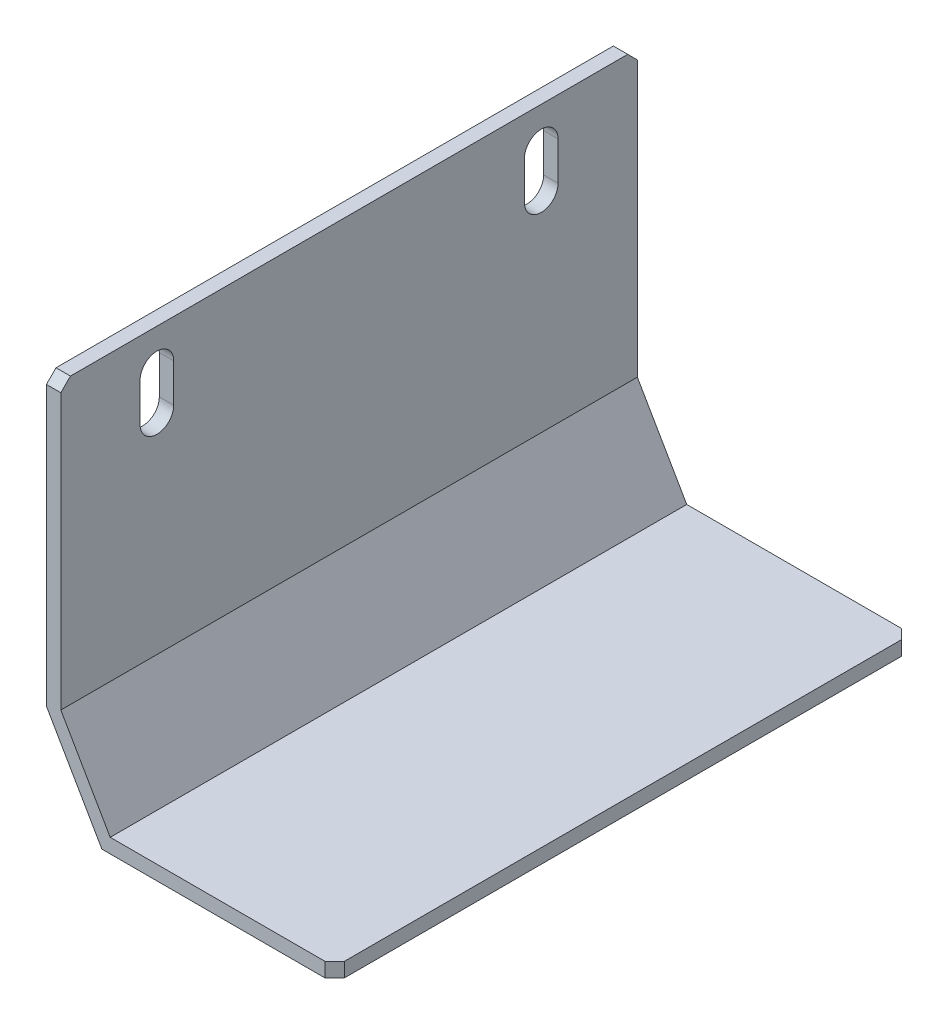
ISO-10303-21;
HEADER;
FILE_DESCRIPTION(('STEP AP214'),'2;1');
FILE_NAME('part.step','',(''),(''),'','','');
FILE_SCHEMA(('AUTOMOTIVE_DESIGN { 1 0 10303 214 1 1 1 1 }'));
ENDSEC;
DATA;
#1=APPLICATION_CONTEXT('core data for automotive mechanical design processes');
#2=APPLICATION_PROTOCOL_DEFINITION('international standard','automotive_design',2000,#1);
#3=PRODUCT_CONTEXT('',#1,'mechanical');
#4=PRODUCT('Part','Part','',(#3));
#5=PRODUCT_RELATED_PRODUCT_CATEGORY('part','',(#4));
#6=PRODUCT_DEFINITION_FORMATION('','',#4);
#7=PRODUCT_DEFINITION_CONTEXT('part definition',#1,'design');
#8=PRODUCT_DEFINITION('design','',#6,#7);
#9=PRODUCT_DEFINITION_SHAPE('','',#8);
#10=(LENGTH_UNIT() NAMED_UNIT(*) SI_UNIT(.MILLI.,.METRE.));
#11=(NAMED_UNIT(*) PLANE_ANGLE_UNIT() SI_UNIT($,.RADIAN.));
#12=(NAMED_UNIT(*) SI_UNIT($,.STERADIAN.) SOLID_ANGLE_UNIT());
#13=UNCERTAINTY_MEASURE_WITH_UNIT(LENGTH_MEASURE(1.E-05),#10,'distance_accuracy_value','');
#14=(GEOMETRIC_REPRESENTATION_CONTEXT(3) GLOBAL_UNCERTAINTY_ASSIGNED_CONTEXT((#13)) GLOBAL_UNIT_ASSIGNED_CONTEXT((#10,
#11,#12)) REPRESENTATION_CONTEXT('',''));
#15=CARTESIAN_POINT('',(0.,0.,0.));
#16=DIRECTION('',(0.,0.,1.));
#17=DIRECTION('',(1.,0.,0.));
#18=AXIS2_PLACEMENT_3D('',#15,#16,#17);
#19=CARTESIAN_POINT('',(-13.3720930232558,15.7558139534884,60.));
#20=DIRECTION('',(1.,0.,0.));
#21=DIRECTION('',(0.,0.,-1.));
#22=AXIS2_PLACEMENT_3D('',#19,#20,#21);
#23=PLANE('',#22);
#24=DIRECTION('',(0.,-1.,0.));
#25=VECTOR('',#24,1.);
#26=CARTESIAN_POINT('',(-13.3720930232558,11.7558139534884,48.25));
#27=LINE('',#26,#25);
#28=CARTESIAN_POINT('',(-13.3720930232558,11.7558139534884,48.25));
#29=VERTEX_POINT('',#28);
#30=CARTESIAN_POINT('',(-13.3720930232558,7.75581395348836,48.25));
#31=VERTEX_POINT('',#30);
#32=EDGE_CURVE('E186',#29,#31,#27,.T.);
#33=ORIENTED_EDGE('',*,*,#32,.F.);
#34=CARTESIAN_POINT('',(-13.3720930232558,11.7558139534884,50.));
#35=DIRECTION('',(-1.,0.,0.));
#36=DIRECTION('',(0.,0.,1.));
#37=AXIS2_PLACEMENT_3D('',#34,#35,#36);
#38=CIRCLE('',#37,1.74999999999999);
#39=CARTESIAN_POINT('',(-13.3720930232558,11.7558139534884,51.75));
#40=VERTEX_POINT('',#39);
#41=EDGE_CURVE('E191',#40,#29,#38,.T.);
#42=ORIENTED_EDGE('',*,*,#41,.F.);
#43=DIRECTION('',(0.,1.,0.));
#44=VECTOR('',#43,1.);
#45=CARTESIAN_POINT('',(-13.3720930232558,11.7558139534884,51.75));
#46=LINE('',#45,#44);
#47=CARTESIAN_POINT('',(-13.3720930232558,7.75581395348836,51.75));
#48=VERTEX_POINT('',#47);
#49=EDGE_CURVE('E195',#48,#40,#46,.T.);
#50=ORIENTED_EDGE('',*,*,#49,.F.);
#51=CARTESIAN_POINT('',(-13.3720930232558,7.75581395348836,50.));
#52=DIRECTION('',(-1.,0.,0.));
#53=DIRECTION('',(0.,0.,1.));
#54=AXIS2_PLACEMENT_3D('',#51,#52,#53);
#55=CIRCLE('',#54,1.75000000000001);
#56=EDGE_CURVE('E175',#31,#48,#55,.T.);
#57=ORIENTED_EDGE('',*,*,#56,.F.);
#58=EDGE_LOOP('',(#33,#42,#50,#57));
#59=FACE_BOUND('',#58,.T.);
#60=DIRECTION('',(0.,-1.,0.));
#61=VECTOR('',#60,1.);
#62=CARTESIAN_POINT('',(-13.3720930232558,11.7558139534884,8.25));
#63=LINE('',#62,#61);
#64=CARTESIAN_POINT('',(-13.3720930232558,11.7558139534884,8.25));
#65=VERTEX_POINT('',#64);
#66=CARTESIAN_POINT('',(-13.3720930232558,7.75581395348836,8.25));
#67=VERTEX_POINT('',#66);
#68=EDGE_CURVE('E206',#65,#67,#63,.T.);
#69=ORIENTED_EDGE('',*,*,#68,.F.);
#70=CARTESIAN_POINT('',(-13.3720930232558,11.7558139534884,10.));
#71=DIRECTION('',(-1.,0.,0.));
#72=DIRECTION('',(0.,0.,1.));
#73=AXIS2_PLACEMENT_3D('',#70,#71,#72);
#74=CIRCLE('',#73,1.75);
#75=CARTESIAN_POINT('',(-13.3720930232558,11.7558139534884,11.75));
#76=VERTEX_POINT('',#75);
#77=EDGE_CURVE('E202',#76,#65,#74,.T.);
#78=ORIENTED_EDGE('',*,*,#77,.F.);
#79=DIRECTION('',(0.,1.,0.));
#80=VECTOR('',#79,1.);
#81=CARTESIAN_POINT('',(-13.3720930232558,11.7558139534884,11.75));
#82=LINE('',#81,#80);
#83=CARTESIAN_POINT('',(-13.3720930232558,7.75581395348837,11.75));
#84=VERTEX_POINT('',#83);
#85=EDGE_CURVE('E212',#84,#76,#82,.T.);
#86=ORIENTED_EDGE('',*,*,#85,.F.);
#87=CARTESIAN_POINT('',(-13.3720930232558,7.75581395348837,10.));
#88=DIRECTION('',(-1.,0.,0.));
#89=DIRECTION('',(0.,0.,1.));
#90=AXIS2_PLACEMENT_3D('',#87,#88,#89);
#91=CIRCLE('',#90,1.75);
#92=EDGE_CURVE('E209',#67,#84,#91,.T.);
#93=ORIENTED_EDGE('',*,*,#92,.F.);
#94=EDGE_LOOP('',(#69,#78,#86,#93));
#95=FACE_BOUND('',#94,.T.);
#96=DIRECTION('',(0.,-1.,0.));
#97=VECTOR('',#96,1.);
#98=CARTESIAN_POINT('',(-13.3720930232558,15.7558139534884,60.));
#99=LINE('',#98,#97);
#100=CARTESIAN_POINT('',(-13.3720930232558,14.7558139534884,60.));
#101=VERTEX_POINT('',#100);
#102=CARTESIAN_POINT('',(-13.3720930232558,-14.2441860465116,60.));
#103=VERTEX_POINT('',#102);
#104=EDGE_CURVE('E225',#101,#103,#99,.T.);
#105=ORIENTED_EDGE('',*,*,#104,.F.);
#106=DIRECTION('',(0.,0.707106781186545,-0.70710678118655));
#107=VECTOR('',#106,1.);
#108=CARTESIAN_POINT('',(-13.3720930232558,14.7558139534884,60.));
#109=LINE('',#108,#107);
#110=CARTESIAN_POINT('',(-13.3720930232558,15.7558139534884,59.));
#111=VERTEX_POINT('',#110);
#112=EDGE_CURVE('E320',#101,#111,#109,.T.);
#113=ORIENTED_EDGE('',*,*,#112,.T.);
#114=DIRECTION('',(0.,0.,-1.));
#115=VECTOR('',#114,1.);
#116=CARTESIAN_POINT('',(-13.3720930232558,15.7558139534884,60.));
#117=LINE('',#116,#115);
#118=CARTESIAN_POINT('',(-13.3720930232558,15.7558139534884,1.00000000000001));
#119=VERTEX_POINT('',#118);
#120=EDGE_CURVE('E240',#111,#119,#117,.T.);
#121=ORIENTED_EDGE('',*,*,#120,.T.);
#122=DIRECTION('',(0.,0.707106781186548,0.707106781186548));
#123=VECTOR('',#122,1.);
#124=CARTESIAN_POINT('',(-13.3720930232558,15.7558139534884,1.00000000000001));
#125=LINE('',#124,#123);
#126=CARTESIAN_POINT('',(-13.3720930232558,14.7558139534884,0.));
#127=VERTEX_POINT('',#126);
#128=EDGE_CURVE('E318',#119,#127,#125,.F.);
#129=ORIENTED_EDGE('',*,*,#128,.T.);
#130=DIRECTION('',(0.,-1.,0.));
#131=VECTOR('',#130,1.);
#132=CARTESIAN_POINT('',(-13.3720930232558,15.7558139534884,0.));
#133=LINE('',#132,#131);
#134=CARTESIAN_POINT('',(-13.3720930232558,-14.2441860465116,0.));
#135=VERTEX_POINT('',#134);
#136=EDGE_CURVE('E218',#127,#135,#133,.T.);
#137=ORIENTED_EDGE('',*,*,#136,.T.);
#138=DIRECTION('',(0.,0.,-1.));
#139=VECTOR('',#138,1.);
#140=CARTESIAN_POINT('',(-13.3720930232558,-14.2441860465116,60.));
#141=LINE('',#140,#139);
#142=EDGE_CURVE('E271',#103,#135,#141,.T.);
#143=ORIENTED_EDGE('',*,*,#142,.F.);
#144=EDGE_LOOP('',(#105,#113,#121,#129,#137,#143));
#145=FACE_BOUND('',#144,.T.);
#146=ADVANCED_FACE('F33',(#59,#95,#145),#23,.F.);
#147=CARTESIAN_POINT('',(-13.3720930232558,-14.2441860465116,60.));
#148=DIRECTION('',(0.86602540378444,0.499999999999998,0.));
#149=DIRECTION('',(-0.499999999999998,0.86602540378444,0.));
#150=AXIS2_PLACEMENT_3D('',#147,#148,#149);
#151=PLANE('',#150);
#152=DIRECTION('',(0.499999999999998,-0.86602540378444,0.));
#153=VECTOR('',#152,1.);
#154=CARTESIAN_POINT('',(-13.3720930232558,-14.2441860465116,0.));
#155=LINE('',#154,#153);
#156=CARTESIAN_POINT('',(-7.59859033135957,-24.2441860465116,0.));
#157=VERTEX_POINT('',#156);
#158=EDGE_CURVE('E242',#135,#157,#155,.T.);
#159=ORIENTED_EDGE('',*,*,#158,.T.);
#160=DIRECTION('',(0.,0.,-1.));
#161=VECTOR('',#160,1.);
#162=CARTESIAN_POINT('',(-7.59859033135957,-24.2441860465116,60.));
#163=LINE('',#162,#161);
#164=CARTESIAN_POINT('',(-7.59859033135957,-24.2441860465116,60.));
#165=VERTEX_POINT('',#164);
#166=EDGE_CURVE('E268',#165,#157,#163,.T.);
#167=ORIENTED_EDGE('',*,*,#166,.F.);
#168=DIRECTION('',(0.499999999999998,-0.86602540378444,0.));
#169=VECTOR('',#168,1.);
#170=CARTESIAN_POINT('',(-13.3720930232558,-14.2441860465116,60.));
#171=LINE('',#170,#169);
#172=EDGE_CURVE('E227',#103,#165,#171,.T.);
#173=ORIENTED_EDGE('',*,*,#172,.F.);
#174=ORIENTED_EDGE('',*,*,#142,.T.);
#175=EDGE_LOOP('',(#159,#167,#173,#174));
#176=FACE_BOUND('',#175,.T.);
#177=ADVANCED_FACE('F357',(#176),#151,.F.);
#178=CARTESIAN_POINT('',(-7.59859033135957,-24.2441860465116,60.));
#179=DIRECTION('',(0.,1.,0.));
#180=DIRECTION('',(0.,0.,1.));
#181=AXIS2_PLACEMENT_3D('',#178,#179,#180);
#182=PLANE('',#181);
#183=DIRECTION('',(1.,0.,0.));
#184=VECTOR('',#183,1.);
#185=CARTESIAN_POINT('',(-7.59859033135957,-24.2441860465116,0.));
#186=LINE('',#185,#184);
#187=CARTESIAN_POINT('',(15.6279069767442,-24.2441860465116,0.));
#188=VERTEX_POINT('',#187);
#189=EDGE_CURVE('E244',#157,#188,#186,.T.);
#190=ORIENTED_EDGE('',*,*,#189,.T.);
#191=DIRECTION('',(-0.707106781186548,0.,-0.707106781186548));
#192=VECTOR('',#191,1.);
#193=CARTESIAN_POINT('',(16.6279069767442,-24.2441860465116,1.00000000000001));
#194=LINE('',#193,#192);
#195=CARTESIAN_POINT('',(16.6279069767442,-24.2441860465116,1.00000000000001));
#196=VERTEX_POINT('',#195);
#197=EDGE_CURVE('E310',#188,#196,#194,.F.);
#198=ORIENTED_EDGE('',*,*,#197,.T.);
#199=DIRECTION('',(0.,0.,-1.));
#200=VECTOR('',#199,1.);
#201=CARTESIAN_POINT('',(16.6279069767442,-24.2441860465116,60.));
#202=LINE('',#201,#200);
#203=CARTESIAN_POINT('',(16.6279069767442,-24.2441860465116,59.));
#204=VERTEX_POINT('',#203);
#205=EDGE_CURVE('E265',#204,#196,#202,.T.);
#206=ORIENTED_EDGE('',*,*,#205,.F.);
#207=DIRECTION('',(-0.707106781186548,0.,0.707106781186548));
#208=VECTOR('',#207,1.);
#209=CARTESIAN_POINT('',(15.6279069767442,-24.2441860465116,60.));
#210=LINE('',#209,#208);
#211=CARTESIAN_POINT('',(15.6279069767442,-24.2441860465116,60.));
#212=VERTEX_POINT('',#211);
#213=EDGE_CURVE('E308',#204,#212,#210,.T.);
#214=ORIENTED_EDGE('',*,*,#213,.T.);
#215=DIRECTION('',(1.,0.,0.));
#216=VECTOR('',#215,1.);
#217=CARTESIAN_POINT('',(-7.59859033135957,-24.2441860465116,60.));
#218=LINE('',#217,#216);
#219=EDGE_CURVE('E230',#165,#212,#218,.T.);
#220=ORIENTED_EDGE('',*,*,#219,.F.);
#221=ORIENTED_EDGE('',*,*,#166,.T.);
#222=EDGE_LOOP('',(#190,#198,#206,#214,#220,#221));
#223=FACE_BOUND('',#222,.T.);
#224=ADVANCED_FACE('F362',(#223),#182,.F.);
#225=CARTESIAN_POINT('',(16.6279069767442,-22.7441860465116,60.));
#226=DIRECTION('',(-1.,0.,0.));
#227=DIRECTION('',(0.,0.,1.));
#228=AXIS2_PLACEMENT_3D('',#225,#226,#227);
#229=PLANE('',#228);
#230=ORIENTED_EDGE('',*,*,#205,.T.);
#231=DIRECTION('',(0.,1.,0.));
#232=VECTOR('',#231,1.);
#233=CARTESIAN_POINT('',(16.6279069767442,-22.7441860465116,1.00000000000001));
#234=LINE('',#233,#232);
#235=CARTESIAN_POINT('',(16.6279069767442,-22.7441860465116,1.00000000000001));
#236=VERTEX_POINT('',#235);
#237=EDGE_CURVE('E297',#196,#236,#234,.T.);
#238=ORIENTED_EDGE('',*,*,#237,.T.);
#239=DIRECTION('',(0.,0.,-1.));
#240=VECTOR('',#239,1.);
#241=CARTESIAN_POINT('',(16.6279069767442,-22.7441860465116,60.));
#242=LINE('',#241,#240);
#243=CARTESIAN_POINT('',(16.6279069767442,-22.7441860465116,59.));
#244=VERTEX_POINT('',#243);
#245=EDGE_CURVE('E262',#244,#236,#242,.T.);
#246=ORIENTED_EDGE('',*,*,#245,.F.);
#247=DIRECTION('',(0.,-1.,0.));
#248=VECTOR('',#247,1.);
#249=CARTESIAN_POINT('',(16.6279069767442,-24.2441860465116,59.));
#250=LINE('',#249,#248);
#251=EDGE_CURVE('E295',#244,#204,#250,.T.);
#252=ORIENTED_EDGE('',*,*,#251,.T.);
#253=EDGE_LOOP('',(#230,#238,#246,#252));
#254=FACE_BOUND('',#253,.T.);
#255=ADVANCED_FACE('F388',(#254),#229,.F.);
#256=CARTESIAN_POINT('',(-6.73256492757513,-22.7441860465116,60.));
#257=DIRECTION('',(0.,-1.,0.));
#258=DIRECTION('',(0.,0.,-1.));
#259=AXIS2_PLACEMENT_3D('',#256,#257,#258);
#260=PLANE('',#259);
#261=ORIENTED_EDGE('',*,*,#245,.T.);
#262=DIRECTION('',(0.707106781186548,0.,0.707106781186548));
#263=VECTOR('',#262,1.);
#264=CARTESIAN_POINT('',(16.6279069767442,-22.7441860465116,1.00000000000001));
#265=LINE('',#264,#263);
#266=CARTESIAN_POINT('',(15.6279069767442,-22.7441860465116,0.));
#267=VERTEX_POINT('',#266);
#268=EDGE_CURVE('E302',#236,#267,#265,.F.);
#269=ORIENTED_EDGE('',*,*,#268,.T.);
#270=DIRECTION('',(-1.,0.,0.));
#271=VECTOR('',#270,1.);
#272=CARTESIAN_POINT('',(-6.73256492757513,-22.7441860465116,0.));
#273=LINE('',#272,#271);
#274=CARTESIAN_POINT('',(-6.73256492757513,-22.7441860465116,0.));
#275=VERTEX_POINT('',#274);
#276=EDGE_CURVE('E247',#267,#275,#273,.T.);
#277=ORIENTED_EDGE('',*,*,#276,.T.);
#278=DIRECTION('',(0.,0.,-1.));
#279=VECTOR('',#278,1.);
#280=CARTESIAN_POINT('',(-6.73256492757513,-22.7441860465116,60.));
#281=LINE('',#280,#279);
#282=CARTESIAN_POINT('',(-6.73256492757513,-22.7441860465116,60.));
#283=VERTEX_POINT('',#282);
#284=EDGE_CURVE('E259',#283,#275,#281,.T.);
#285=ORIENTED_EDGE('',*,*,#284,.F.);
#286=DIRECTION('',(-1.,0.,0.));
#287=VECTOR('',#286,1.);
#288=CARTESIAN_POINT('',(-6.73256492757513,-22.7441860465116,60.));
#289=LINE('',#288,#287);
#290=CARTESIAN_POINT('',(15.6279069767442,-22.7441860465116,60.));
#291=VERTEX_POINT('',#290);
#292=EDGE_CURVE('E233',#291,#283,#289,.T.);
#293=ORIENTED_EDGE('',*,*,#292,.F.);
#294=DIRECTION('',(0.707106781186548,0.,-0.707106781186548));
#295=VECTOR('',#294,1.);
#296=CARTESIAN_POINT('',(15.6279069767442,-22.7441860465116,60.));
#297=LINE('',#296,#295);
#298=EDGE_CURVE('E300',#291,#244,#297,.T.);
#299=ORIENTED_EDGE('',*,*,#298,.T.);
#300=EDGE_LOOP('',(#261,#269,#277,#285,#293,#299));
#301=FACE_BOUND('',#300,.T.);
#302=ADVANCED_FACE('F391',(#301),#260,.F.);
#303=CARTESIAN_POINT('',(-11.8720930232558,-13.842262257865,60.));
#304=DIRECTION('',(-0.86602540378444,-0.499999999999998,0.));
#305=DIRECTION('',(0.499999999999998,-0.86602540378444,0.));
#306=AXIS2_PLACEMENT_3D('',#303,#304,#305);
#307=PLANE('',#306);
#308=DIRECTION('',(-0.499999999999998,0.86602540378444,0.));
#309=VECTOR('',#308,1.);
#310=CARTESIAN_POINT('',(-11.8720930232558,-13.842262257865,0.));
#311=LINE('',#310,#309);
#312=CARTESIAN_POINT('',(-11.8720930232558,-13.842262257865,0.));
#313=VERTEX_POINT('',#312);
#314=EDGE_CURVE('E249',#275,#313,#311,.T.);
#315=ORIENTED_EDGE('',*,*,#314,.T.);
#316=DIRECTION('',(0.,0.,-1.));
#317=VECTOR('',#316,1.);
#318=CARTESIAN_POINT('',(-11.8720930232558,-13.842262257865,60.));
#319=LINE('',#318,#317);
#320=CARTESIAN_POINT('',(-11.8720930232558,-13.842262257865,60.));
#321=VERTEX_POINT('',#320);
#322=EDGE_CURVE('E256',#321,#313,#319,.T.);
#323=ORIENTED_EDGE('',*,*,#322,.F.);
#324=DIRECTION('',(-0.499999999999998,0.86602540378444,0.));
#325=VECTOR('',#324,1.);
#326=CARTESIAN_POINT('',(-11.8720930232558,-13.842262257865,60.));
#327=LINE('',#326,#325);
#328=EDGE_CURVE('E235',#283,#321,#327,.T.);
#329=ORIENTED_EDGE('',*,*,#328,.F.);
#330=ORIENTED_EDGE('',*,*,#284,.T.);
#331=EDGE_LOOP('',(#315,#323,#329,#330));
#332=FACE_BOUND('',#331,.T.);
#333=ADVANCED_FACE('F393',(#332),#307,.F.);
#334=CARTESIAN_POINT('',(-11.8720930232558,15.7558139534884,60.));
#335=DIRECTION('',(-1.,0.,0.));
#336=DIRECTION('',(0.,-1.,0.));
#337=AXIS2_PLACEMENT_3D('',#334,#335,#336);
#338=PLANE('',#337);
#339=DIRECTION('',(0.,1.,0.));
#340=VECTOR('',#339,1.);
#341=CARTESIAN_POINT('',(-11.8720930232558,15.7558139534883,51.75));
#342=LINE('',#341,#340);
#343=CARTESIAN_POINT('',(-11.8720930232558,7.75581395348836,51.75));
#344=VERTEX_POINT('',#343);
#345=CARTESIAN_POINT('',(-11.8720930232558,11.7558139534884,51.75));
#346=VERTEX_POINT('',#345);
#347=EDGE_CURVE('E289',#344,#346,#342,.T.);
#348=ORIENTED_EDGE('',*,*,#347,.T.);
#349=CARTESIAN_POINT('',(-11.8720930232558,11.7558139534884,50.));
#350=DIRECTION('',(-1.,0.,0.));
#351=DIRECTION('',(0.,-1.,0.));
#352=AXIS2_PLACEMENT_3D('',#349,#350,#351);
#353=CIRCLE('',#352,1.74999999999999);
#354=CARTESIAN_POINT('',(-11.8720930232558,11.7558139534884,48.25));
#355=VERTEX_POINT('',#354);
#356=EDGE_CURVE('E292',#346,#355,#353,.T.);
#357=ORIENTED_EDGE('',*,*,#356,.T.);
#358=DIRECTION('',(0.,-1.,0.));
#359=VECTOR('',#358,1.);
#360=CARTESIAN_POINT('',(-11.8720930232558,15.7558139534884,48.25));
#361=LINE('',#360,#359);
#362=CARTESIAN_POINT('',(-11.8720930232558,7.75581395348836,48.25));
#363=VERTEX_POINT('',#362);
#364=EDGE_CURVE('E286',#355,#363,#361,.T.);
#365=ORIENTED_EDGE('',*,*,#364,.T.);
#366=CARTESIAN_POINT('',(-11.8720930232558,7.75581395348836,50.));
#367=DIRECTION('',(-1.,0.,0.));
#368=DIRECTION('',(0.,-1.,0.));
#369=AXIS2_PLACEMENT_3D('',#366,#367,#368);
#370=CIRCLE('',#369,1.75000000000001);
#371=EDGE_CURVE('E178',#363,#344,#370,.T.);
#372=ORIENTED_EDGE('',*,*,#371,.T.);
#373=EDGE_LOOP('',(#348,#357,#365,#372));
#374=FACE_BOUND('',#373,.T.);
#375=DIRECTION('',(0.,1.,0.));
#376=VECTOR('',#375,1.);
#377=CARTESIAN_POINT('',(-11.8720930232558,15.7558139534884,11.75));
#378=LINE('',#377,#376);
#379=CARTESIAN_POINT('',(-11.8720930232558,7.75581395348837,11.75));
#380=VERTEX_POINT('',#379);
#381=CARTESIAN_POINT('',(-11.8720930232558,11.7558139534884,11.75));
#382=VERTEX_POINT('',#381);
#383=EDGE_CURVE('E280',#380,#382,#378,.T.);
#384=ORIENTED_EDGE('',*,*,#383,.T.);
#385=CARTESIAN_POINT('',(-11.8720930232558,11.7558139534884,10.));
#386=DIRECTION('',(-1.,0.,0.));
#387=DIRECTION('',(0.,-1.,0.));
#388=AXIS2_PLACEMENT_3D('',#385,#386,#387);
#389=CIRCLE('',#388,1.75);
#390=CARTESIAN_POINT('',(-11.8720930232558,11.7558139534884,8.25));
#391=VERTEX_POINT('',#390);
#392=EDGE_CURVE('E283',#382,#391,#389,.T.);
#393=ORIENTED_EDGE('',*,*,#392,.T.);
#394=DIRECTION('',(0.,-1.,0.));
#395=VECTOR('',#394,1.);
#396=CARTESIAN_POINT('',(-11.8720930232558,15.7558139534883,8.25));
#397=LINE('',#396,#395);
#398=CARTESIAN_POINT('',(-11.8720930232558,7.75581395348836,8.25));
#399=VERTEX_POINT('',#398);
#400=EDGE_CURVE('E274',#391,#399,#397,.T.);
#401=ORIENTED_EDGE('',*,*,#400,.T.);
#402=CARTESIAN_POINT('',(-11.8720930232558,7.75581395348837,10.));
#403=DIRECTION('',(-1.,0.,0.));
#404=DIRECTION('',(0.,-1.,0.));
#405=AXIS2_PLACEMENT_3D('',#402,#403,#404);
#406=CIRCLE('',#405,1.75);
#407=EDGE_CURVE('E277',#399,#380,#406,.T.);
#408=ORIENTED_EDGE('',*,*,#407,.T.);
#409=EDGE_LOOP('',(#384,#393,#401,#408));
#410=FACE_BOUND('',#409,.T.);
#411=DIRECTION('',(0.,0.,-1.));
#412=VECTOR('',#411,1.);
#413=CARTESIAN_POINT('',(-11.8720930232558,15.7558139534884,60.));
#414=LINE('',#413,#412);
#415=CARTESIAN_POINT('',(-11.8720930232558,15.7558139534884,59.));
#416=VERTEX_POINT('',#415);
#417=CARTESIAN_POINT('',(-11.8720930232558,15.7558139534884,1.00000000000001));
#418=VERTEX_POINT('',#417);
#419=EDGE_CURVE('E254',#416,#418,#414,.T.);
#420=ORIENTED_EDGE('',*,*,#419,.F.);
#421=DIRECTION('',(0.,-0.707106781186545,0.70710678118655));
#422=VECTOR('',#421,1.);
#423=CARTESIAN_POINT('',(-11.8720930232558,14.7558139534884,60.));
#424=LINE('',#423,#422);
#425=CARTESIAN_POINT('',(-11.8720930232558,14.7558139534884,60.));
#426=VERTEX_POINT('',#425);
#427=EDGE_CURVE('E11',#416,#426,#424,.T.);
#428=ORIENTED_EDGE('',*,*,#427,.T.);
#429=DIRECTION('',(0.,1.,0.));
#430=VECTOR('',#429,1.);
#431=CARTESIAN_POINT('',(-11.8720930232558,15.7558139534884,60.));
#432=LINE('',#431,#430);
#433=EDGE_CURVE('E237',#321,#426,#432,.T.);
#434=ORIENTED_EDGE('',*,*,#433,.F.);
#435=ORIENTED_EDGE('',*,*,#322,.T.);
#436=DIRECTION('',(0.,1.,0.));
#437=VECTOR('',#436,1.);
#438=CARTESIAN_POINT('',(-11.8720930232558,15.7558139534884,0.));
#439=LINE('',#438,#437);
#440=CARTESIAN_POINT('',(-11.8720930232558,14.7558139534884,0.));
#441=VERTEX_POINT('',#440);
#442=EDGE_CURVE('E228',#313,#441,#439,.T.);
#443=ORIENTED_EDGE('',*,*,#442,.T.);
#444=DIRECTION('',(0.,-0.707106781186548,-0.707106781186548));
#445=VECTOR('',#444,1.);
#446=CARTESIAN_POINT('',(-11.8720930232558,15.7558139534884,1.00000000000001));
#447=LINE('',#446,#445);
#448=EDGE_CURVE('E41',#441,#418,#447,.F.);
#449=ORIENTED_EDGE('',*,*,#448,.T.);
#450=EDGE_LOOP('',(#420,#428,#434,#435,#443,#449));
#451=FACE_BOUND('',#450,.T.);
#452=ADVANCED_FACE('F342',(#374,#410,#451),#338,.F.);
#453=CARTESIAN_POINT('',(-13.3720930232558,15.7558139534884,60.));
#454=DIRECTION('',(0.,-1.,0.));
#455=DIRECTION('',(0.,0.,-1.));
#456=AXIS2_PLACEMENT_3D('',#453,#454,#455);
#457=PLANE('',#456);
#458=ORIENTED_EDGE('',*,*,#120,.F.);
#459=DIRECTION('',(1.,0.,0.));
#460=VECTOR('',#459,1.);
#461=CARTESIAN_POINT('',(-11.8720930232558,15.7558139534884,59.));
#462=LINE('',#461,#460);
#463=EDGE_CURVE('E54',#111,#416,#462,.T.);
#464=ORIENTED_EDGE('',*,*,#463,.T.);
#465=ORIENTED_EDGE('',*,*,#419,.T.);
#466=DIRECTION('',(-1.,0.,0.));
#467=VECTOR('',#466,1.);
#468=CARTESIAN_POINT('',(-13.3720930232558,15.7558139534884,1.00000000000001));
#469=LINE('',#468,#467);
#470=EDGE_CURVE('E322',#418,#119,#469,.T.);
#471=ORIENTED_EDGE('',*,*,#470,.T.);
#472=EDGE_LOOP('',(#458,#464,#465,#471));
#473=FACE_BOUND('',#472,.T.);
#474=ADVANCED_FACE('F326',(#473),#457,.F.);
#475=CARTESIAN_POINT('',(0.,0.,60.));
#476=DIRECTION('',(0.,0.,1.));
#477=DIRECTION('',(1.,0.,0.));
#478=AXIS2_PLACEMENT_3D('',#475,#476,#477);
#479=PLANE('',#478);
#480=ORIENTED_EDGE('',*,*,#219,.T.);
#481=DIRECTION('',(0.,1.,0.));
#482=VECTOR('',#481,1.);
#483=CARTESIAN_POINT('',(15.6279069767442,-22.7441860465116,60.));
#484=LINE('',#483,#482);
#485=EDGE_CURVE('E315',#212,#291,#484,.T.);
#486=ORIENTED_EDGE('',*,*,#485,.T.);
#487=ORIENTED_EDGE('',*,*,#292,.T.);
#488=ORIENTED_EDGE('',*,*,#328,.T.);
#489=ORIENTED_EDGE('',*,*,#433,.T.);
#490=DIRECTION('',(-1.,0.,0.));
#491=VECTOR('',#490,1.);
#492=CARTESIAN_POINT('',(-13.3720930232558,14.7558139534884,60.));
#493=LINE('',#492,#491);
#494=EDGE_CURVE('E312',#426,#101,#493,.T.);
#495=ORIENTED_EDGE('',*,*,#494,.T.);
#496=ORIENTED_EDGE('',*,*,#104,.T.);
#497=ORIENTED_EDGE('',*,*,#172,.T.);
#498=EDGE_LOOP('',(#480,#486,#487,#488,#489,#495,#496,#497));
#499=FACE_BOUND('',#498,.T.);
#500=ADVANCED_FACE('F337',(#499),#479,.T.);
#501=CARTESIAN_POINT('',(0.,0.,0.));
#502=DIRECTION('',(0.,0.,1.));
#503=DIRECTION('',(1.,0.,0.));
#504=AXIS2_PLACEMENT_3D('',#501,#502,#503);
#505=PLANE('',#504);
#506=ORIENTED_EDGE('',*,*,#276,.F.);
#507=DIRECTION('',(0.,-1.,0.));
#508=VECTOR('',#507,1.);
#509=CARTESIAN_POINT('',(15.6279069767442,0.,0.));
#510=LINE('',#509,#508);
#511=EDGE_CURVE('E306',#267,#188,#510,.T.);
#512=ORIENTED_EDGE('',*,*,#511,.T.);
#513=ORIENTED_EDGE('',*,*,#189,.F.);
#514=ORIENTED_EDGE('',*,*,#158,.F.);
#515=ORIENTED_EDGE('',*,*,#136,.F.);
#516=DIRECTION('',(1.,0.,0.));
#517=VECTOR('',#516,1.);
#518=CARTESIAN_POINT('',(0.,14.7558139534884,0.));
#519=LINE('',#518,#517);
#520=EDGE_CURVE('E304',#127,#441,#519,.T.);
#521=ORIENTED_EDGE('',*,*,#520,.T.);
#522=ORIENTED_EDGE('',*,*,#442,.F.);
#523=ORIENTED_EDGE('',*,*,#314,.F.);
#524=EDGE_LOOP('',(#506,#512,#513,#514,#515,#521,#522,#523));
#525=FACE_BOUND('',#524,.T.);
#526=ADVANCED_FACE('F348',(#525),#505,.F.);
#527=CARTESIAN_POINT('',(46.6279069767442,11.7558139534884,10.));
#528=DIRECTION('',(-1.,0.,0.));
#529=DIRECTION('',(0.,0.,1.));
#530=AXIS2_PLACEMENT_3D('',#527,#528,#529);
#531=CYLINDRICAL_SURFACE('',#530,1.75);
#532=DIRECTION('',(-1.,0.,0.));
#533=VECTOR('',#532,1.);
#534=CARTESIAN_POINT('',(46.6279069767442,11.7558139534884,11.75));
#535=LINE('',#534,#533);
#536=EDGE_CURVE('E216',#382,#76,#535,.T.);
#537=ORIENTED_EDGE('',*,*,#536,.T.);
#538=ORIENTED_EDGE('',*,*,#77,.T.);
#539=DIRECTION('',(-1.,0.,0.));
#540=VECTOR('',#539,1.);
#541=CARTESIAN_POINT('',(46.6279069767442,11.7558139534884,8.25));
#542=LINE('',#541,#540);
#543=EDGE_CURVE('E215',#391,#65,#542,.T.);
#544=ORIENTED_EDGE('',*,*,#543,.F.);
#545=ORIENTED_EDGE('',*,*,#392,.F.);
#546=EDGE_LOOP('',(#537,#538,#544,#545));
#547=FACE_BOUND('',#546,.T.);
#548=ADVANCED_FACE('F450',(#547),#531,.F.);
#549=CARTESIAN_POINT('',(46.6279069767442,11.7558139534884,11.75));
#550=DIRECTION('',(0.,0.,1.));
#551=DIRECTION('',(1.,0.,0.));
#552=AXIS2_PLACEMENT_3D('',#549,#550,#551);
#553=PLANE('',#552);
#554=DIRECTION('',(-1.,0.,0.));
#555=VECTOR('',#554,1.);
#556=CARTESIAN_POINT('',(46.6279069767442,7.75581395348837,11.75));
#557=LINE('',#556,#555);
#558=EDGE_CURVE('E219',#380,#84,#557,.T.);
#559=ORIENTED_EDGE('',*,*,#558,.T.);
#560=ORIENTED_EDGE('',*,*,#85,.T.);
#561=ORIENTED_EDGE('',*,*,#536,.F.);
#562=ORIENTED_EDGE('',*,*,#383,.F.);
#563=EDGE_LOOP('',(#559,#560,#561,#562));
#564=FACE_BOUND('',#563,.T.);
#565=ADVANCED_FACE('F517',(#564),#553,.F.);
#566=CARTESIAN_POINT('',(46.6279069767442,7.75581395348837,10.));
#567=DIRECTION('',(-1.,0.,0.));
#568=DIRECTION('',(0.,0.,1.));
#569=AXIS2_PLACEMENT_3D('',#566,#567,#568);
#570=CYLINDRICAL_SURFACE('',#569,1.75);
#571=DIRECTION('',(-1.,0.,0.));
#572=VECTOR('',#571,1.);
#573=CARTESIAN_POINT('',(46.6279069767442,7.75581395348836,8.25));
#574=LINE('',#573,#572);
#575=EDGE_CURVE('E221',#399,#67,#574,.T.);
#576=ORIENTED_EDGE('',*,*,#575,.T.);
#577=ORIENTED_EDGE('',*,*,#92,.T.);
#578=ORIENTED_EDGE('',*,*,#558,.F.);
#579=ORIENTED_EDGE('',*,*,#407,.F.);
#580=EDGE_LOOP('',(#576,#577,#578,#579));
#581=FACE_BOUND('',#580,.T.);
#582=ADVANCED_FACE('F509',(#581),#570,.F.);
#583=CARTESIAN_POINT('',(46.6279069767442,11.7558139534884,8.25));
#584=DIRECTION('',(0.,0.,-1.));
#585=DIRECTION('',(0.,1.,0.));
#586=AXIS2_PLACEMENT_3D('',#583,#584,#585);
#587=PLANE('',#586);
#588=ORIENTED_EDGE('',*,*,#543,.T.);
#589=ORIENTED_EDGE('',*,*,#68,.T.);
#590=ORIENTED_EDGE('',*,*,#575,.F.);
#591=ORIENTED_EDGE('',*,*,#400,.F.);
#592=EDGE_LOOP('',(#588,#589,#590,#591));
#593=FACE_BOUND('',#592,.T.);
#594=ADVANCED_FACE('F501',(#593),#587,.F.);
#595=CARTESIAN_POINT('',(46.6279069767442,11.7558139534884,50.));
#596=DIRECTION('',(-1.,0.,0.));
#597=DIRECTION('',(0.,0.,1.));
#598=AXIS2_PLACEMENT_3D('',#595,#596,#597);
#599=CYLINDRICAL_SURFACE('',#598,1.74999999999999);
#600=DIRECTION('',(-1.,0.,0.));
#601=VECTOR('',#600,1.);
#602=CARTESIAN_POINT('',(46.6279069767442,11.7558139534884,51.75));
#603=LINE('',#602,#601);
#604=EDGE_CURVE('E200',#346,#40,#603,.T.);
#605=ORIENTED_EDGE('',*,*,#604,.T.);
#606=ORIENTED_EDGE('',*,*,#41,.T.);
#607=DIRECTION('',(-1.,0.,0.));
#608=VECTOR('',#607,1.);
#609=CARTESIAN_POINT('',(46.6279069767442,11.7558139534884,48.25));
#610=LINE('',#609,#608);
#611=EDGE_CURVE('E182',#355,#29,#610,.T.);
#612=ORIENTED_EDGE('',*,*,#611,.F.);
#613=ORIENTED_EDGE('',*,*,#356,.F.);
#614=EDGE_LOOP('',(#605,#606,#612,#613));
#615=FACE_BOUND('',#614,.T.);
#616=ADVANCED_FACE('F493',(#615),#599,.F.);
#617=CARTESIAN_POINT('',(46.6279069767442,11.7558139534884,51.75));
#618=DIRECTION('',(0.,0.,1.));
#619=DIRECTION('',(0.,-1.,0.));
#620=AXIS2_PLACEMENT_3D('',#617,#618,#619);
#621=PLANE('',#620);
#622=DIRECTION('',(-1.,0.,0.));
#623=VECTOR('',#622,1.);
#624=CARTESIAN_POINT('',(46.6279069767442,7.75581395348836,51.75));
#625=LINE('',#624,#623);
#626=EDGE_CURVE('E181',#344,#48,#625,.T.);
#627=ORIENTED_EDGE('',*,*,#626,.T.);
#628=ORIENTED_EDGE('',*,*,#49,.T.);
#629=ORIENTED_EDGE('',*,*,#604,.F.);
#630=ORIENTED_EDGE('',*,*,#347,.F.);
#631=EDGE_LOOP('',(#627,#628,#629,#630));
#632=FACE_BOUND('',#631,.T.);
#633=ADVANCED_FACE('F486',(#632),#621,.F.);
#634=CARTESIAN_POINT('',(46.6279069767442,7.75581395348836,50.));
#635=DIRECTION('',(-1.,0.,0.));
#636=DIRECTION('',(0.,0.,1.));
#637=AXIS2_PLACEMENT_3D('',#634,#635,#636);
#638=CYLINDRICAL_SURFACE('',#637,1.75000000000001);
#639=DIRECTION('',(-1.,0.,0.));
#640=VECTOR('',#639,1.);
#641=CARTESIAN_POINT('',(46.6279069767442,7.75581395348836,48.25));
#642=LINE('',#641,#640);
#643=EDGE_CURVE('E170',#363,#31,#642,.T.);
#644=ORIENTED_EDGE('',*,*,#643,.T.);
#645=ORIENTED_EDGE('',*,*,#56,.T.);
#646=ORIENTED_EDGE('',*,*,#626,.F.);
#647=ORIENTED_EDGE('',*,*,#371,.F.);
#648=EDGE_LOOP('',(#644,#645,#646,#647));
#649=FACE_BOUND('',#648,.T.);
#650=ADVANCED_FACE('F172',(#649),#638,.F.);
#651=CARTESIAN_POINT('',(46.6279069767442,11.7558139534884,48.25));
#652=DIRECTION('',(0.,0.,-1.));
#653=DIRECTION('',(0.,1.,0.));
#654=AXIS2_PLACEMENT_3D('',#651,#652,#653);
#655=PLANE('',#654);
#656=ORIENTED_EDGE('',*,*,#611,.T.);
#657=ORIENTED_EDGE('',*,*,#32,.T.);
#658=ORIENTED_EDGE('',*,*,#643,.F.);
#659=ORIENTED_EDGE('',*,*,#364,.F.);
#660=EDGE_LOOP('',(#656,#657,#658,#659));
#661=FACE_BOUND('',#660,.T.);
#662=ADVANCED_FACE('F187',(#661),#655,.F.);
#663=CARTESIAN_POINT('',(16.6279069767442,-22.7441860465116,1.00000000000001));
#664=DIRECTION('',(-0.707106781186547,0.,0.707106781186547));
#665=DIRECTION('',(0.,1.,0.));
#666=AXIS2_PLACEMENT_3D('',#663,#664,#665);
#667=PLANE('',#666);
#668=ORIENTED_EDGE('',*,*,#197,.F.);
#669=ORIENTED_EDGE('',*,*,#511,.F.);
#670=ORIENTED_EDGE('',*,*,#268,.F.);
#671=ORIENTED_EDGE('',*,*,#237,.F.);
#672=EDGE_LOOP('',(#668,#669,#670,#671));
#673=FACE_BOUND('',#672,.T.);
#674=ADVANCED_FACE('F367',(#673),#667,.F.);
#675=CARTESIAN_POINT('',(15.6279069767442,0.,60.));
#676=DIRECTION('',(0.707106781186547,0.,0.707106781186547));
#677=DIRECTION('',(0.,-1.,0.));
#678=AXIS2_PLACEMENT_3D('',#675,#676,#677);
#679=PLANE('',#678);
#680=ORIENTED_EDGE('',*,*,#213,.F.);
#681=ORIENTED_EDGE('',*,*,#251,.F.);
#682=ORIENTED_EDGE('',*,*,#298,.F.);
#683=ORIENTED_EDGE('',*,*,#485,.F.);
#684=EDGE_LOOP('',(#680,#681,#682,#683));
#685=FACE_BOUND('',#684,.T.);
#686=ADVANCED_FACE('F355',(#685),#679,.T.);
#687=CARTESIAN_POINT('',(0.,14.7558139534884,60.));
#688=DIRECTION('',(0.,0.70710678118655,0.707106781186545));
#689=DIRECTION('',(1.,0.,0.));
#690=AXIS2_PLACEMENT_3D('',#687,#688,#689);
#691=PLANE('',#690);
#692=ORIENTED_EDGE('',*,*,#427,.F.);
#693=ORIENTED_EDGE('',*,*,#463,.F.);
#694=ORIENTED_EDGE('',*,*,#112,.F.);
#695=ORIENTED_EDGE('',*,*,#494,.F.);
#696=EDGE_LOOP('',(#692,#693,#694,#695));
#697=FACE_BOUND('',#696,.T.);
#698=ADVANCED_FACE('F335',(#697),#691,.T.);
#699=CARTESIAN_POINT('',(-13.3720930232558,15.7558139534884,1.00000000000001));
#700=DIRECTION('',(0.,-0.707106781186547,0.707106781186547));
#701=DIRECTION('',(-1.,0.,0.));
#702=AXIS2_PLACEMENT_3D('',#699,#700,#701);
#703=PLANE('',#702);
#704=ORIENTED_EDGE('',*,*,#448,.F.);
#705=ORIENTED_EDGE('',*,*,#520,.F.);
#706=ORIENTED_EDGE('',*,*,#128,.F.);
#707=ORIENTED_EDGE('',*,*,#470,.F.);
#708=EDGE_LOOP('',(#704,#705,#706,#707));
#709=FACE_BOUND('',#708,.T.);
#710=ADVANCED_FACE('F35',(#709),#703,.F.);
#711=CLOSED_SHELL('',(#146,#177,#224,#255,#302,#333,#452,#474,#500,#526,#548,#565,#582,#594,
#616,#633,#650,#662,#674,#686,#698,#710));
#712=MANIFOLD_SOLID_BREP('B2',#711);
#713=ADVANCED_BREP_SHAPE_REPRESENTATION('',(#18,#712),#14);
#714=SHAPE_DEFINITION_REPRESENTATION(#9,#713);
ENDSEC;
END-ISO-10303-21;
